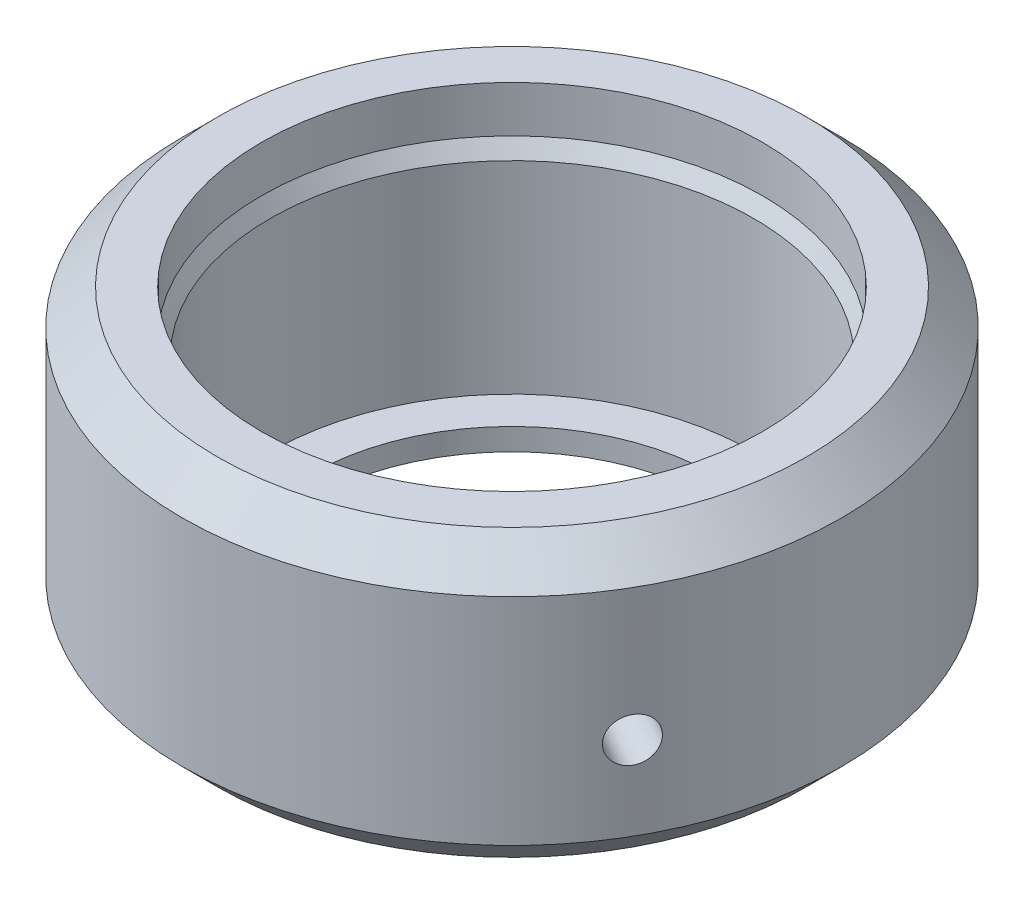
ISO-10303-21;
HEADER;
FILE_DESCRIPTION(('STEP AP214'),'2;1');
FILE_NAME('part.step','',(''),(''),'','','');
FILE_SCHEMA(('AUTOMOTIVE_DESIGN { 1 0 10303 214 1 1 1 1 }'));
ENDSEC;
DATA;
#1=APPLICATION_CONTEXT('core data for automotive mechanical design processes');
#2=APPLICATION_PROTOCOL_DEFINITION('international standard','automotive_design',2000,#1);
#3=PRODUCT_CONTEXT('',#1,'mechanical');
#4=PRODUCT('Part','Part','',(#3));
#5=PRODUCT_RELATED_PRODUCT_CATEGORY('part','',(#4));
#6=PRODUCT_DEFINITION_FORMATION('','',#4);
#7=PRODUCT_DEFINITION_CONTEXT('part definition',#1,'design');
#8=PRODUCT_DEFINITION('design','',#6,#7);
#9=PRODUCT_DEFINITION_SHAPE('','',#8);
#10=(LENGTH_UNIT() NAMED_UNIT(*) SI_UNIT(.MILLI.,.METRE.));
#11=(NAMED_UNIT(*) PLANE_ANGLE_UNIT() SI_UNIT($,.RADIAN.));
#12=(NAMED_UNIT(*) SI_UNIT($,.STERADIAN.) SOLID_ANGLE_UNIT());
#13=UNCERTAINTY_MEASURE_WITH_UNIT(LENGTH_MEASURE(1.E-05),#10,'distance_accuracy_value','');
#14=(GEOMETRIC_REPRESENTATION_CONTEXT(3) GLOBAL_UNCERTAINTY_ASSIGNED_CONTEXT((#13)) GLOBAL_UNIT_ASSIGNED_CONTEXT((#10,
#11,#12)) REPRESENTATION_CONTEXT('',''));
#15=CARTESIAN_POINT('',(0.,0.,0.));
#16=DIRECTION('',(0.,0.,1.));
#17=DIRECTION('',(1.,0.,0.));
#18=AXIS2_PLACEMENT_3D('',#15,#16,#17);
#19=CARTESIAN_POINT('',(0.,5.,0.));
#20=DIRECTION('',(0.,1.,0.));
#21=DIRECTION('',(0.,0.,1.));
#22=AXIS2_PLACEMENT_3D('',#19,#20,#21);
#23=PLANE('',#22);
#24=CARTESIAN_POINT('',(0.,5.,0.));
#25=DIRECTION('',(0.,1.,0.));
#26=DIRECTION('',(0.,0.,1.));
#27=AXIS2_PLACEMENT_3D('',#24,#25,#26);
#28=CIRCLE('',#27,46.);
#29=CARTESIAN_POINT('',(0.,5.,46.));
#30=VERTEX_POINT('',#29);
#31=EDGE_CURVE('E18',#30,#30,#28,.F.);
#32=ORIENTED_EDGE('',*,*,#31,.T.);
#33=EDGE_LOOP('',(#32));
#34=FACE_BOUND('',#33,.T.);
#35=CARTESIAN_POINT('',(0.,5.,0.));
#36=DIRECTION('',(0.,1.,0.));
#37=DIRECTION('',(0.,0.,1.));
#38=AXIS2_PLACEMENT_3D('',#35,#36,#37);
#39=CIRCLE('',#38,55.);
#40=CARTESIAN_POINT('',(0.,5.,55.));
#41=VERTEX_POINT('',#40);
#42=EDGE_CURVE('E116',#41,#41,#39,.T.);
#43=ORIENTED_EDGE('',*,*,#42,.T.);
#44=EDGE_LOOP('',(#43));
#45=FACE_BOUND('',#44,.T.);
#46=ADVANCED_FACE('F15',(#34,#45),#23,.T.);
#47=CARTESIAN_POINT('',(0.,54.4641016151031,0.));
#48=DIRECTION('',(0.,1.,0.));
#49=DIRECTION('',(0.,0.,1.));
#50=AXIS2_PLACEMENT_3D('',#47,#48,#49);
#51=CONICAL_SURFACE('',#50,56.9999999999946,0.523598775598);
#52=CARTESIAN_POINT('',(0.,51.,0.));
#53=DIRECTION('',(0.,1.,0.));
#54=DIRECTION('',(0.,0.,1.));
#55=AXIS2_PLACEMENT_3D('',#52,#53,#54);
#56=CIRCLE('',#55,55.);
#57=CARTESIAN_POINT('',(0.,51.,55.));
#58=VERTEX_POINT('',#57);
#59=EDGE_CURVE('E31',#58,#58,#56,.F.);
#60=ORIENTED_EDGE('',*,*,#59,.T.);
#61=EDGE_LOOP('',(#60));
#62=FACE_BOUND('',#61,.T.);
#63=CARTESIAN_POINT('',(0.,54.4641016151,0.));
#64=DIRECTION('',(0.,1.,0.));
#65=DIRECTION('',(0.,0.,1.));
#66=AXIS2_PLACEMENT_3D('',#63,#64,#65);
#67=CIRCLE('',#66,57.);
#68=CARTESIAN_POINT('',(0.,54.4641016151,57.));
#69=VERTEX_POINT('',#68);
#70=EDGE_CURVE('E113',#69,#69,#67,.T.);
#71=ORIENTED_EDGE('',*,*,#70,.T.);
#72=EDGE_LOOP('',(#71));
#73=FACE_BOUND('',#72,.T.);
#74=ADVANCED_FACE('F100',(#62,#73),#51,.F.);
#75=CARTESIAN_POINT('',(0.,-14.8,0.));
#76=DIRECTION('',(0.,1.,0.));
#77=DIRECTION('',(0.,0.,1.));
#78=AXIS2_PLACEMENT_3D('',#75,#76,#77);
#79=CYLINDRICAL_SURFACE('',#78,46.);
#80=CARTESIAN_POINT('',(0.,0.,0.));
#81=DIRECTION('',(0.,1.,0.));
#82=DIRECTION('',(0.,0.,1.));
#83=AXIS2_PLACEMENT_3D('',#80,#81,#82);
#84=CIRCLE('',#83,46.);
#85=CARTESIAN_POINT('',(0.,0.,46.));
#86=VERTEX_POINT('',#85);
#87=EDGE_CURVE('E84',#86,#86,#84,.F.);
#88=ORIENTED_EDGE('',*,*,#87,.T.);
#89=EDGE_LOOP('',(#88));
#90=FACE_BOUND('',#89,.T.);
#91=ORIENTED_EDGE('',*,*,#31,.F.);
#92=EDGE_LOOP('',(#91));
#93=FACE_BOUND('',#92,.T.);
#94=ADVANCED_FACE('F97',(#90,#93),#79,.F.);
#95=CARTESIAN_POINT('',(0.,0.226794919243,0.));
#96=DIRECTION('',(0.,1.,0.));
#97=DIRECTION('',(0.,0.,1.));
#98=AXIS2_PLACEMENT_3D('',#95,#96,#97);
#99=CYLINDRICAL_SURFACE('',#98,55.);
#100=ORIENTED_EDGE('',*,*,#42,.F.);
#101=EDGE_LOOP('',(#100));
#102=FACE_BOUND('',#101,.T.);
#103=CARTESIAN_POINT('',(49.9341649025134,27.,23.0560008563493));
#104=CARTESIAN_POINT('',(49.9341646831106,27.1400524558636,23.0560016059474));
#105=CARTESIAN_POINT('',(49.9316866792325,27.2801286113787,23.0613704849242));
#106=CARTESIAN_POINT('',(49.9217798817729,27.5593390878845,23.0828080834393));
#107=CARTESIAN_POINT('',(49.9143486889913,27.6984729194302,23.0988819882195));
#108=CARTESIAN_POINT('',(49.8945413156316,27.9749887511215,23.1416356996972));
#109=CARTESIAN_POINT('',(49.882156846797,28.1123674147543,23.1683332824835));
#110=CARTESIAN_POINT('',(49.8524789423696,28.3842029225961,23.2321238704768));
#111=CARTESIAN_POINT('',(49.8351836552412,28.5186586441387,23.2692207965018));
#112=CARTESIAN_POINT('',(49.7957718035326,28.7834637683973,23.3534423018323));
#113=CARTESIAN_POINT('',(49.7736617196794,28.9138184238087,23.400553400024));
#114=CARTESIAN_POINT('',(49.7246754070137,29.1697369217857,23.5044666833726));
#115=CARTESIAN_POINT('',(49.6977974210375,29.2952989772831,23.5612724411078));
#116=CARTESIAN_POINT('',(49.6394022951887,29.5405981238879,23.6840527514007));
#117=CARTESIAN_POINT('',(49.6078889564006,29.6603398817253,23.7500197890687));
#118=CARTESIAN_POINT('',(49.5403131644782,29.8933127354319,23.8906562787399));
#119=CARTESIAN_POINT('',(49.5042490317664,30.0065414049146,23.9653289429809));
#120=CARTESIAN_POINT('',(49.4276305274464,30.2259130669551,24.1229566046696));
#121=CARTESIAN_POINT('',(49.3870655185197,30.3320382806394,24.2059311752824));
#122=CARTESIAN_POINT('',(49.3016697909683,30.536194558105,24.3793909190933));
#123=CARTESIAN_POINT('',(49.2568375011667,30.6342226155754,24.4698788570724));
#124=CARTESIAN_POINT('',(49.1631301420865,30.8214247144555,24.6576080437347));
#125=CARTESIAN_POINT('',(49.1142561889423,30.9106011854255,24.754847426776));
#126=CARTESIAN_POINT('',(49.0126639626494,31.0795321555249,24.955388355847));
#127=CARTESIAN_POINT('',(48.9599442773914,31.1592831652817,25.0586921259046));
#128=CARTESIAN_POINT('',(48.8508635838258,31.3088591290109,25.2706816586983));
#129=CARTESIAN_POINT('',(48.7944977824968,31.3786706147861,25.3793744599359));
#130=CARTESIAN_POINT('',(48.6784652876514,31.5077637936086,25.6012245001598));
#131=CARTESIAN_POINT('',(48.6187973791334,31.5670415765692,25.714383377975));
#132=CARTESIAN_POINT('',(48.4965308244681,31.6745871169516,25.9442366959174));
#133=CARTESIAN_POINT('',(48.4339333516371,31.7228592375171,26.0609297140934));
#134=CARTESIAN_POINT('',(48.3061549500618,31.8080866118851,26.2970239837125));
#135=CARTESIAN_POINT('',(48.2409730665324,31.8450376383845,26.4164262289517));
#136=CARTESIAN_POINT('',(48.0425739195286,31.93824707524,26.7765886198401));
#137=CARTESIAN_POINT('',(47.9060258717888,31.9772811093191,27.0202039873204));
#138=CARTESIAN_POINT('',(47.6278765262335,32.0078811155544,27.5075274216295));
#139=CARTESIAN_POINT('',(47.4862753294983,31.9994480366878,27.7512354865077));
#140=CARTESIAN_POINT('',(47.2735075651719,31.9515812340089,28.111119446485));
#141=CARTESIAN_POINT('',(47.2025912466276,31.9297933115947,28.2300245932263));
#142=CARTESIAN_POINT('',(47.0610783765541,31.8746909347557,28.465306689131));
#143=CARTESIAN_POINT('',(46.990481715374,31.8413807933296,28.581684567003));
#144=CARTESIAN_POINT('',(46.8501289950332,31.7634554823514,28.8111702280211));
#145=CARTESIAN_POINT('',(46.7803732711757,31.7188359500871,28.924276730399));
#146=CARTESIAN_POINT('',(46.642312241264,31.6186382637426,29.1463856702377));
#147=CARTESIAN_POINT('',(46.5740064158544,31.5630641095839,29.2553895884477));
#148=CARTESIAN_POINT('',(46.4392594866758,31.4412301635673,29.468816376505));
#149=CARTESIAN_POINT('',(46.3728220921958,31.3749506659594,29.5732303376763));
#150=CARTESIAN_POINT('',(46.242532545933,31.2322782681088,29.7765471282467));
#151=CARTESIAN_POINT('',(46.1786794599752,31.1558890657348,29.8754519540399));
#152=CARTESIAN_POINT('',(46.0540678437818,30.9934940842437,30.0671900036574));
#153=CARTESIAN_POINT('',(45.99331025933,30.9074853913801,30.1600213742616));
#154=CARTESIAN_POINT('',(45.8754705872491,30.7265090360888,30.338962962367));
#155=CARTESIAN_POINT('',(45.8183871660028,30.6315446555294,30.4250756210063));
#156=CARTESIAN_POINT('',(45.7081782083963,30.4329186829776,30.5903964408339));
#157=CARTESIAN_POINT('',(45.6550685357965,30.3292254137514,30.669577122303));
#158=CARTESIAN_POINT('',(45.5535598771481,30.1142256381617,30.8201464339936));
#159=CARTESIAN_POINT('',(45.5051591688542,30.0029219407717,30.8915379141877));
#160=CARTESIAN_POINT('',(45.4134653975182,29.7733544778492,31.0261793157647));
#161=CARTESIAN_POINT('',(45.3701766452195,29.6550849624487,31.0894223698837));
#162=CARTESIAN_POINT('',(45.2891862816459,29.4125506682875,31.207286320829));
#163=CARTESIAN_POINT('',(45.2514825979048,29.2882881361751,31.2619104164079));
#164=CARTESIAN_POINT('',(45.1819650183459,29.0344330944785,31.3622985786138));
#165=CARTESIAN_POINT('',(45.1501592231563,28.9048335486517,31.4080504633292));
#166=CARTESIAN_POINT('',(45.0928290437925,28.6414347641686,31.4903045918895));
#167=CARTESIAN_POINT('',(45.0673022796643,28.5076371384686,31.5268103404729));
#168=CARTESIAN_POINT('',(45.0228100827017,28.2369853358395,31.5903161351384));
#169=CARTESIAN_POINT('',(45.0038335735914,28.1001367394368,31.6173322293058));
#170=CARTESIAN_POINT('',(44.9725819798215,27.8241921578405,31.6617689349636));
#171=CARTESIAN_POINT('',(44.9603036200017,27.685097305306,31.6791942360528));
#172=CARTESIAN_POINT('',(44.9456840835575,27.4548371097946,31.699930189001));
#173=CARTESIAN_POINT('',(44.9413663255226,27.3640361798798,31.7060501769074));
#174=CARTESIAN_POINT('',(44.9356065593277,27.1821601747837,31.7142127135207));
#175=CARTESIAN_POINT('',(44.9341645516668,27.0910850995548,31.7162552615198));
#176=CARTESIAN_POINT('',(44.9341654419887,26.8599475441367,31.7162543293846));
#177=CARTESIAN_POINT('',(44.9375760256319,26.719871388622,31.7114238755804));
#178=CARTESIAN_POINT('',(44.9511881318111,26.4406609121164,31.6921255380479));
#179=CARTESIAN_POINT('',(44.9613929452984,26.3015270805707,31.6776529839304));
#180=CARTESIAN_POINT('',(44.9885150588647,26.0250112488793,31.6391224396811));
#181=CARTESIAN_POINT('',(45.0054436093598,25.8876325852463,31.6150483836644));
#182=CARTESIAN_POINT('',(45.0458489268706,25.6157970774042,31.5574512705021));
#183=CARTESIAN_POINT('',(45.0693281636465,25.4813413558614,31.5239246494708));
#184=CARTESIAN_POINT('',(45.1225602009535,25.2165362316026,31.4476822320157));
#185=CARTESIAN_POINT('',(45.1523045668611,25.0861815761911,31.4049787886232));
#186=CARTESIAN_POINT('',(45.2178029536989,24.8302630782139,31.3105987557425));
#187=CARTESIAN_POINT('',(45.2535591899907,24.7047010227165,31.258918858217));
#188=CARTESIAN_POINT('',(45.3306924948646,24.4594018761117,31.1469570406283));
#189=CARTESIAN_POINT('',(45.3720649559034,24.3396601182743,31.0866821698458));
#190=CARTESIAN_POINT('',(45.4600718326965,24.1066872645678,30.9578415725246));
#191=CARTESIAN_POINT('',(45.5067081905416,23.9934585950852,30.8892727853103));
#192=CARTESIAN_POINT('',(45.6049084977432,23.7740869330448,30.744105383325));
#193=CARTESIAN_POINT('',(45.6564840792987,23.6679617193606,30.6674877697833));
#194=CARTESIAN_POINT('',(45.7640067601972,23.463805441895,30.5068030284438));
#195=CARTESIAN_POINT('',(45.8199554683224,23.3657773844246,30.4227331575763));
#196=CARTESIAN_POINT('',(45.9356800334637,23.1785752855445,30.2477156107602));
#197=CARTESIAN_POINT('',(45.9954548328538,23.0893988145745,30.1567698342333));
#198=CARTESIAN_POINT('',(46.1183322587814,22.9204678444751,29.9685179209011));
#199=CARTESIAN_POINT('',(46.1814361053291,22.8407168347182,29.8712094491594));
#200=CARTESIAN_POINT('',(46.3104840792822,22.691140870989,29.6707480310723));
#201=CARTESIAN_POINT('',(46.376431905698,22.6213293852139,29.5675874145979));
#202=CARTESIAN_POINT('',(46.5105434289399,22.4922362063913,29.3561753062854));
#203=CARTESIAN_POINT('',(46.5787079375326,22.4329584234307,29.2479219428106));
#204=CARTESIAN_POINT('',(46.7166334726824,22.3254128830483,29.0271093414661));
#205=CARTESIAN_POINT('',(46.7863938544516,22.2771407624829,28.9145518306938));
#206=CARTESIAN_POINT('',(46.926968288842,22.1919133881148,28.6858453540651));
#207=CARTESIAN_POINT('',(46.9977827247235,22.1549623616155,28.5696950644426));
#208=CARTESIAN_POINT('',(47.2104929312188,22.06175292476,28.217795167604));
#209=CARTESIAN_POINT('',(47.3531960043392,22.0227188906809,27.9777334056842));
#210=CARTESIAN_POINT('',(47.636155805533,21.9921188844456,27.4931872892328));
#211=CARTESIAN_POINT('',(47.7764125824571,22.0005519633122,27.2487030232148));
#212=CARTESIAN_POINT('',(47.981697352049,22.0484187659911,26.8844987542131));
#213=CARTESIAN_POINT('',(48.0492140704956,22.0702066884053,26.7636308474403));
#214=CARTESIAN_POINT('',(48.182217907568,22.1253090652443,26.5234360590419));
#215=CARTESIAN_POINT('',(48.2477057756537,22.1586192066704,26.4041086181016));
#216=CARTESIAN_POINT('',(48.3762698277294,22.2365445176487,26.1678167662872));
#217=CARTESIAN_POINT('',(48.4393450701931,22.281164049913,26.0508532861783));
#218=CARTESIAN_POINT('',(48.5626665395453,22.3813617362574,25.8202344570829));
#219=CARTESIAN_POINT('',(48.6229137891225,22.4369358904161,25.7065779179467));
#220=CARTESIAN_POINT('',(48.740373344839,22.5587698364328,25.4831702601675));
#221=CARTESIAN_POINT('',(48.7975797904831,22.6250493340407,25.3734268082009));
#222=CARTESIAN_POINT('',(48.9085125230018,22.7677217318913,25.1589343560046));
#223=CARTESIAN_POINT('',(48.9622400717167,22.8441109342653,25.0541835485586));
#224=CARTESIAN_POINT('',(49.0659842854609,23.0065059157565,24.8503976985197));
#225=CARTESIAN_POINT('',(49.1159998184464,23.09251460862,24.7513644016098));
#226=CARTESIAN_POINT('',(49.2120479434988,23.2734909639113,24.5598414579615));
#227=CARTESIAN_POINT('',(49.2580819828448,23.3684553444707,24.4673494357077));
#228=CARTESIAN_POINT('',(49.3461495337867,23.5670813170225,24.2892452687822));
#229=CARTESIAN_POINT('',(49.3881671791281,23.6707745862487,24.2036606023895));
#230=CARTESIAN_POINT('',(49.4678096987583,23.8857743618383,24.0404668694507));
#231=CARTESIAN_POINT('',(49.5054361800732,23.9970780592282,23.96285488641));
#232=CARTESIAN_POINT('',(49.5761921685721,24.2266455221507,23.8161250502758));
#233=CARTESIAN_POINT('',(49.6093178839028,24.3449150375513,23.7470143640275));
#234=CARTESIAN_POINT('',(49.6708958778251,24.5874493317126,23.6179426762383));
#235=CARTESIAN_POINT('',(49.6993498903847,24.7117118638249,23.5579782805129));
#236=CARTESIAN_POINT('',(49.7515297993149,24.9655669055217,23.4475802095022));
#237=CARTESIAN_POINT('',(49.7752491961546,25.0951664513486,23.3971596405227));
#238=CARTESIAN_POINT('',(49.8178182713722,25.3585652358319,23.30638318451));
#239=CARTESIAN_POINT('',(49.8366697949654,25.492362861532,23.2660234840069));
#240=CARTESIAN_POINT('',(49.8694213279521,25.763014664161,23.1957392138344));
#241=CARTESIAN_POINT('',(49.8833296972571,25.8998632605636,23.165797027786));
#242=CARTESIAN_POINT('',(49.9061872163318,26.1758078421597,23.1165140008438));
#243=CARTESIAN_POINT('',(49.9151387898332,26.3149026946942,23.0971679787787));
#244=CARTESIAN_POINT('',(49.9257868836373,26.5451628902055,23.0741391123519));
#245=CARTESIAN_POINT('',(49.9289280696188,26.6359638201202,23.0673398302528));
#246=CARTESIAN_POINT('',(49.9331171505844,26.8178398252162,23.0582704581025));
#247=CARTESIAN_POINT('',(49.9341650452052,26.9089149004452,23.0560003688376));
#248=CARTESIAN_POINT('',(49.9341649025134,27.,23.0560008563493));
#249=B_SPLINE_CURVE_WITH_KNOTS('',3,(#103,#104,#105,#106,#107,#108,#109,#110,#111,#112,#113,
#114,#115,#116,#117,#118,#119,#120,#121,#122,#123,#124,#125,#126,#127,#128,#129,#130,#131,#132,
#133,#134,#135,#136,#137,#138,#139,#140,#141,#142,#143,#144,#145,#146,#147,#148,#149,#150,#151,
#152,#153,#154,#155,#156,#157,#158,#159,#160,#161,#162,#163,#164,#165,#166,#167,#168,#169,#170,
#171,#172,#173,#174,#175,#176,#177,#178,#179,#180,#181,#182,#183,#184,#185,#186,#187,#188,#189,
#190,#191,#192,#193,#194,#195,#196,#197,#198,#199,#200,#201,#202,#203,#204,#205,#206,#207,#208,
#209,#210,#211,#212,#213,#214,#215,#216,#217,#218,#219,#220,#221,#222,#223,#224,#225,#226,#227,
#228,#229,#230,#231,#232,#233,#234,#235,#236,#237,#238,#239,#240,#241,#242,#243,#244,#245,#246,
#247,#248),.UNSPECIFIED.,.T.,.F.,(4,2,2,2,2,2,2,2,2,2,2,2,2,2,2,2,2,2,2,2,2,2,2,2,2,2,2,2,2,2,2,
2,2,2,2,2,2,2,2,2,2,2,2,2,2,2,2,2,2,2,2,2,2,2,2,2,2,2,2,2,2,2,2,2,2,2,2,2,2,2,2,2,4),(0.,
0.420073891223613,0.840351403678815,1.26133512337001,1.68247777863887,2.10305704063447,
2.52379162624822,2.94418310464884,3.36473019471167,3.78629326902516,4.20801216419457,
4.6296149851037,5.05137340067649,5.47369797415982,5.89617898758607,6.3184922179999,
6.74096294877347,7.58264295393847,8.42430613203715,8.84434369757892,9.26422420443425,
9.68426693162013,10.1041565694487,10.5248281127272,10.945346208309,11.3659920256771,
11.7864842893228,12.2085743769582,12.6305095054295,13.0527979348019,13.4749292698356,
13.8976361673013,14.3201825975521,14.7420109739492,15.1636329057662,15.4368338669647,
15.7100348755908,16.1301087668137,16.5503862792689,16.9713699989605,17.3925126542299,
17.8130919162258,18.2338265018398,18.6542179802402,19.0747650703028,19.4963281446162,
19.9180470397855,20.3396498606947,20.7614082762676,21.183732849751,21.6062138631773,
22.0285270935911,22.4509978243646,23.2926778295296,24.1343410076283,24.55437857317,
24.9742590800253,25.3943018072112,25.8141914450398,26.2348629883183,26.6553810839003,
27.0760269012683,27.4965191649139,27.9186092525492,28.3405443810203,28.7628328103928,
29.1849641454267,29.6076710428926,30.0302174731437,30.4520458495405,30.8736677813573,
31.1468687425556,31.4200697511816),.UNSPECIFIED.);
#250=CARTESIAN_POINT('',(49.9341649025134,27.,23.0560008563493));
#251=VERTEX_POINT('',#250);
#252=EDGE_CURVE('E80',#251,#251,#249,.T.);
#253=ORIENTED_EDGE('',*,*,#252,.T.);
#254=EDGE_LOOP('',(#253));
#255=FACE_BOUND('',#254,.T.);
#256=ORIENTED_EDGE('',*,*,#59,.F.);
#257=EDGE_LOOP('',(#256));
#258=FACE_BOUND('',#257,.T.);
#259=ADVANCED_FACE('F91',(#102,#255,#258),#99,.F.);
#260=CARTESIAN_POINT('',(0.,0.226794919243,0.));
#261=DIRECTION('',(0.,1.,0.));
#262=DIRECTION('',(0.,0.,1.));
#263=AXIS2_PLACEMENT_3D('',#260,#261,#262);
#264=CYLINDRICAL_SURFACE('',#263,57.);
#265=ORIENTED_EDGE('',*,*,#70,.F.);
#266=EDGE_LOOP('',(#265));
#267=FACE_BOUND('',#266,.T.);
#268=CARTESIAN_POINT('',(0.,65.,0.));
#269=DIRECTION('',(0.,1.,0.));
#270=DIRECTION('',(0.,0.,1.));
#271=AXIS2_PLACEMENT_3D('',#268,#269,#270);
#272=CIRCLE('',#271,57.);
#273=CARTESIAN_POINT('',(0.,65.,57.));
#274=VERTEX_POINT('',#273);
#275=EDGE_CURVE('E76',#274,#274,#272,.F.);
#276=ORIENTED_EDGE('',*,*,#275,.F.);
#277=EDGE_LOOP('',(#276));
#278=FACE_BOUND('',#277,.T.);
#279=ADVANCED_FACE('F96',(#267,#278),#264,.F.);
#280=CARTESIAN_POINT('',(0.,0.,0.));
#281=DIRECTION('',(0.,1.,0.));
#282=DIRECTION('',(0.,0.,1.));
#283=AXIS2_PLACEMENT_3D('',#280,#281,#282);
#284=PLANE('',#283);
#285=ORIENTED_EDGE('',*,*,#87,.F.);
#286=EDGE_LOOP('',(#285));
#287=FACE_BOUND('',#286,.T.);
#288=CARTESIAN_POINT('',(0.,0.,0.));
#289=DIRECTION('',(0.,1.,0.));
#290=DIRECTION('',(0.,0.,1.));
#291=AXIS2_PLACEMENT_3D('',#288,#289,#290);
#292=CIRCLE('',#291,66.9999862654897);
#293=CARTESIAN_POINT('',(0.,0.,66.9999862654897));
#294=VERTEX_POINT('',#293);
#295=EDGE_CURVE('E46',#294,#294,#292,.T.);
#296=ORIENTED_EDGE('',*,*,#295,.F.);
#297=EDGE_LOOP('',(#296));
#298=FACE_BOUND('',#297,.T.);
#299=ADVANCED_FACE('F71',(#287,#298),#284,.F.);
#300=CARTESIAN_POINT('',(64.9519052838,27.,37.5));
#301=DIRECTION('',(-0.866025403784329,0.,-0.50000000000019));
#302=DIRECTION('',(-0.50000000000019,0.,0.866025403784329));
#303=AXIS2_PLACEMENT_3D('',#300,#301,#302);
#304=CYLINDRICAL_SURFACE('',#303,5.);
#305=CARTESIAN_POINT('',(62.3074069840694,27.,41.7467008866753));
#306=CARTESIAN_POINT('',(62.3074074861104,27.1401994469576,41.7467002911984));
#307=CARTESIAN_POINT('',(62.3106999599183,27.2804233951994,41.7417873824169));
#308=CARTESIAN_POINT('',(62.3238432818683,27.5599302769909,41.72216070842));
#309=CARTESIAN_POINT('',(62.333697333337,27.6992127173359,41.7074421561409));
#310=CARTESIAN_POINT('',(62.359896051621,27.976028719541,41.6682603521341));
#311=CARTESIAN_POINT('',(62.3762516889803,28.1135589178319,41.6437806295385));
#312=CARTESIAN_POINT('',(62.415307418382,28.3856967596066,41.5852213803083));
#313=CARTESIAN_POINT('',(62.4380099004094,28.5203032815251,41.5511382373458));
#314=CARTESIAN_POINT('',(62.4895120149786,28.7854143956203,41.473642810776));
#315=CARTESIAN_POINT('',(62.5183038236183,28.9159240069547,41.430242497315));
#316=CARTESIAN_POINT('',(62.5817482069081,29.1721440348353,41.3343452317404));
#317=CARTESIAN_POINT('',(62.6164029415956,29.2978526615891,41.2818449268043));
#318=CARTESIAN_POINT('',(62.6912183925425,29.5434290589723,41.1681401283053));
#319=CARTESIAN_POINT('',(62.7313745261004,29.6633015796369,41.1069428777884));
#320=CARTESIAN_POINT('',(62.8168688814516,29.8965153291552,40.9761770512115));
#321=CARTESIAN_POINT('',(62.8622090131757,30.0098541275191,40.9066053892814));
#322=CARTESIAN_POINT('',(62.9577143990435,30.2292873172563,40.7594638962406));
#323=CARTESIAN_POINT('',(63.0078854598257,30.3353727217421,40.6818844317145));
#324=CARTESIAN_POINT('',(63.1125847140798,30.5394359359606,40.5192670571247));
#325=CARTESIAN_POINT('',(63.167114510573,30.6374107356225,40.4342264019105));
#326=CARTESIAN_POINT('',(63.2800271290261,30.8244897774911,40.2572872241693));
#327=CARTESIAN_POINT('',(63.3384088724225,30.9135964854236,40.1653906204061));
#328=CARTESIAN_POINT('',(63.4585638009289,31.0823704039535,39.9752839517123));
#329=CARTESIAN_POINT('',(63.5203382300083,31.1620341178896,39.8770715687377));
#330=CARTESIAN_POINT('',(63.6467750060881,31.3113573319504,39.6749573884008));
#331=CARTESIAN_POINT('',(63.7114388662404,31.3810115077936,39.5710526034191));
#332=CARTESIAN_POINT('',(63.8431138234919,31.5097919133778,39.3582581000635));
#333=CARTESIAN_POINT('',(63.9101257801333,31.5689142386251,39.2493665516661));
#334=CARTESIAN_POINT('',(64.045911258607,31.6761551761755,39.0274025779541));
#335=CARTESIAN_POINT('',(64.1146840826765,31.7242780743165,38.9143318010608));
#336=CARTESIAN_POINT('',(64.2534751677001,31.8092171999472,38.6847383654824));
#337=CARTESIAN_POINT('',(64.3234938843054,31.8460291969741,38.5682144330828));
#338=CARTESIAN_POINT('',(64.534326996492,31.9389240389082,38.2151191460154));
#339=CARTESIAN_POINT('',(64.6762730720848,31.9777446610178,37.9744454728639));
#340=CARTESIAN_POINT('',(64.9586925587562,32.0078785442037,37.4892920829422));
#341=CARTESIAN_POINT('',(65.0991659856969,31.9991923175098,37.2448124072375));
#342=CARTESIAN_POINT('',(65.3055882374112,31.9508965648093,36.880886161425));
#343=CARTESIAN_POINT('',(65.3736638473385,31.9289305459991,36.7600740355212));
#344=CARTESIAN_POINT('',(65.5080050761982,31.8734301566731,36.5201329772484));
#345=CARTESIAN_POINT('',(65.5742713625434,31.8399001157823,36.4010034322654));
#346=CARTESIAN_POINT('',(65.704592111578,31.7614928874273,36.1652421986604));
#347=CARTESIAN_POINT('',(65.7686457135702,31.7166113396702,36.0486114885962));
#348=CARTESIAN_POINT('',(65.8940961689231,31.6158478634393,35.8187830654639));
#349=CARTESIAN_POINT('',(65.9554939878311,31.5599699745472,35.705584109288));
#350=CARTESIAN_POINT('',(66.0753574380403,31.4375278369065,35.4832792879561));
#351=CARTESIAN_POINT('',(66.1338194615707,31.3709508424793,35.3741784985543));
#352=CARTESIAN_POINT('',(66.2473706910375,31.2276587584922,35.1610644214211));
#353=CARTESIAN_POINT('',(66.3024611261532,31.1509473962229,35.0570492824301));
#354=CARTESIAN_POINT('',(66.4089985915394,30.9878873826605,34.8548127988402));
#355=CARTESIAN_POINT('',(66.4604445452444,30.9015359029581,34.7565931676313));
#356=CARTESIAN_POINT('',(66.5593780148241,30.7198582192044,34.5667564779846));
#357=CARTESIAN_POINT('',(66.60686697635,30.6245353201244,34.4751370099088));
#358=CARTESIAN_POINT('',(66.6977554627325,30.4253486104688,34.2989688470936));
#359=CARTESIAN_POINT('',(66.7411460838704,30.3214670823713,34.2144355901167));
#360=CARTESIAN_POINT('',(66.8234873741324,30.1061140258595,34.0533363760883));
#361=CARTESIAN_POINT('',(66.8624396710157,29.9946453041692,33.9767674989969));
#362=CARTESIAN_POINT('',(66.9357611767427,29.7647750296687,33.8320921722314));
#363=CARTESIAN_POINT('',(66.9701265084103,29.6463677320817,33.7639928848336));
#364=CARTESIAN_POINT('',(67.0340579697725,29.4035895002707,33.6368865036269));
#365=CARTESIAN_POINT('',(67.0636258735214,29.2792207926738,33.5778760492444));
#366=CARTESIAN_POINT('',(67.1178732325256,29.0251994447716,33.4693110480961));
#367=CARTESIAN_POINT('',(67.1425464159366,28.8955402786289,33.4197686361355));
#368=CARTESIAN_POINT('',(67.1868345983051,28.6320588432693,33.3306425710748));
#369=CARTESIAN_POINT('',(67.2064515063952,28.4982381667934,33.2910551593346));
#370=CARTESIAN_POINT('',(67.2405207487787,28.2275767956956,33.2221890211941));
#371=CARTESIAN_POINT('',(67.2549818232519,28.0907416335025,33.1928928503146));
#372=CARTESIAN_POINT('',(67.2787156723388,27.8148567991697,33.1447603955084));
#373=CARTESIAN_POINT('',(67.2879909905833,27.6758082471892,33.1259189835216));
#374=CARTESIAN_POINT('',(67.2989043125692,27.4471276494529,33.1037394138415));
#375=CARTESIAN_POINT('',(67.3020921105015,27.3578597473958,33.0972569988191));
#376=CARTESIAN_POINT('',(67.3063435308545,27.179064561302,33.0886104822334));
#377=CARTESIAN_POINT('',(67.3074071531056,27.0895372772445,33.0864463810147));
#378=CARTESIAN_POINT('',(67.3074067193937,26.8598005530424,33.0864475813507));
#379=CARTESIAN_POINT('',(67.3047982524864,26.7195766048006,33.0917554017003));
#380=CARTESIAN_POINT('',(67.2943727151883,26.4400697230091,33.1129511893975));
#381=CARTESIAN_POINT('',(67.286553100742,26.3007872826641,33.1288443244393));
#382=CARTESIAN_POINT('',(67.265720022248,26.023971280459,33.1711239820232));
#383=CARTESIAN_POINT('',(67.2526977792822,25.8864410821681,33.1975282407692));
#384=CARTESIAN_POINT('',(67.2215118465232,25.6143032403934,33.2606311192095));
#385=CARTESIAN_POINT('',(67.2033462198905,25.4796967184749,33.2973336168555));
#386=CARTESIAN_POINT('',(67.1619842690885,25.2145856043797,33.3806834697058));
#387=CARTESIAN_POINT('',(67.1387943994189,25.0840759930453,33.4273180641392));
#388=CARTESIAN_POINT('',(67.0874671229227,24.8278559651647,33.5302111445829));
#389=CARTESIAN_POINT('',(67.0593278924854,24.7021473384109,33.5864731776517));
#390=CARTESIAN_POINT('',(66.9982643739265,24.4565709410277,33.7081176580168));
#391=CARTESIAN_POINT('',(66.965344067116,24.3366984203631,33.7734925150541));
#392=CARTESIAN_POINT('',(66.894844717029,24.1034846708448,33.9129157119569));
#393=CARTESIAN_POINT('',(66.8572639562761,23.9901458724809,33.9869672488058));
#394=CARTESIAN_POINT('',(66.7775883782858,23.7707126827437,34.143248085686));
#395=CARTESIAN_POINT('',(66.7354881215852,23.6646272782579,34.2254872311213));
#396=CARTESIAN_POINT('',(66.6470069712208,23.4605640640394,34.3974681323574));
#397=CARTESIAN_POINT('',(66.6006245016973,23.3625892643775,34.4872126489908));
#398=CARTESIAN_POINT('',(66.5038469880752,23.1755102225089,34.6734674338495));
#399=CARTESIAN_POINT('',(66.4534530663929,23.0864035145764,34.7699758086297));
#400=CARTESIAN_POINT('',(66.3488933261283,22.9176295960466,34.9690863634529));
#401=CARTESIAN_POINT('',(66.2947261220458,22.8379658821104,35.0716907798272));
#402=CARTESIAN_POINT('',(66.1829084954488,22.6886426680496,35.2822453300534));
#403=CARTESIAN_POINT('',(66.1252562421559,22.6189884922064,35.3901982681429));
#404=CARTESIAN_POINT('',(66.00680827509,22.4902080866222,35.6106293778427));
#405=CARTESIAN_POINT('',(65.946011406241,22.4310857613749,35.7231092088501));
#406=CARTESIAN_POINT('',(65.8216777055183,22.3238448238245,35.9516848695293));
#407=CARTESIAN_POINT('',(65.7581419523378,22.2757219256835,36.0677792707101));
#408=CARTESIAN_POINT('',(65.6287037470964,22.1907828000528,36.3027725939484));
#409=CARTESIAN_POINT('',(65.5628004197921,22.1539708030259,36.4216725474688));
#410=CARTESIAN_POINT('',(65.3624274873283,22.0610759610918,36.780807022115));
#411=CARTESIAN_POINT('',(65.2249710101533,22.0222553389822,37.0240727661215));
#412=CARTESIAN_POINT('',(64.9460255930844,21.9921214557963,37.5112319110635));
#413=CARTESIAN_POINT('',(64.8045366966854,22.0008076824902,37.755125305203));
#414=CARTESIAN_POINT('',(64.5925784485649,22.0491034351907,38.1158553420002));
#415=CARTESIAN_POINT('',(64.5219898834106,22.0710694540009,38.2352166125272));
#416=CARTESIAN_POINT('',(64.3813654459652,22.1265698433269,38.4715300586316));
#417=CARTESIAN_POINT('',(64.3113293768411,22.1600998842177,38.5884831185126));
#418=CARTESIAN_POINT('',(64.1723145338289,22.2385071125727,38.8192248146191));
#419=CARTESIAN_POINT('',(64.1033361770479,22.2833886603299,38.9330122161803));
#420=CARTESIAN_POINT('',(63.96702415178,22.3841521365607,39.1565697089984));
#421=CARTESIAN_POINT('',(63.8996898895037,22.4400300254528,39.2663412579976));
#422=CARTESIAN_POINT('',(63.767099991951,22.5624721630935,39.4812984615299));
#423=CARTESIAN_POINT('',(63.7018469485213,22.6290491575207,39.5864784537647));
#424=CARTESIAN_POINT('',(63.5740603585532,22.7723412415078,39.7913737416805));
#425=CARTESIAN_POINT('',(63.5115258233666,22.8490526037771,39.8910910274917));
#426=CARTESIAN_POINT('',(63.3896526236987,23.0121126173395,40.0844734207658));
#427=CARTESIAN_POINT('',(63.3303149047739,23.0984640970419,40.1781367392007));
#428=CARTESIAN_POINT('',(63.2153782437594,23.2801417807956,40.3587339819645));
#429=CARTESIAN_POINT('',(63.1597779376874,23.3754646798756,40.4456703630833));
#430=CARTESIAN_POINT('',(63.0526560765426,23.5746513895312,40.6124661826095));
#431=CARTESIAN_POINT('',(63.0011434391048,23.6785329176287,40.6923101912893));
#432=CARTESIAN_POINT('',(62.9027980723574,23.8938859741405,40.8441694474508));
#433=CARTESIAN_POINT('',(62.8559636280987,24.0053546958308,40.9161875646332));
#434=CARTESIAN_POINT('',(62.7673318726824,24.2352249703313,41.0520235146191));
#435=CARTESIAN_POINT('',(62.72553882565,24.3536322679183,41.1158344085517));
#436=CARTESIAN_POINT('',(62.6474272012229,24.5964104997293,41.2347538687957));
#437=CARTESIAN_POINT('',(62.6111066005133,24.7207792073262,41.2898656517702));
#438=CARTESIAN_POINT('',(62.544210231059,24.9748005552284,41.3911277433301));
#439=CARTESIAN_POINT('',(62.5136418354419,25.1044597213711,41.4372665529366));
#440=CARTESIAN_POINT('',(62.4586004901442,25.3679411567307,41.5201842764854));
#441=CARTESIAN_POINT('',(62.4341252399521,25.5017618332066,41.5569667231053));
#442=CARTESIAN_POINT('',(62.3915200360537,25.7724232043044,41.6209046215673));
#443=CARTESIAN_POINT('',(62.3733793450751,25.9092583664975,41.6480763648669));
#444=CARTESIAN_POINT('',(62.3435623410097,26.1851432008303,41.6926967085088));
#445=CARTESIAN_POINT('',(62.3318828587082,26.3241917528108,41.7101500757301));
#446=CARTESIAN_POINT('',(62.3181314489132,26.5528723505471,41.7306910746497));
#447=CARTESIAN_POINT('',(62.314111411792,26.6421402526042,41.7366929961523));
#448=CARTESIAN_POINT('',(62.3087490189511,26.820935438698,41.744698092473));
#449=CARTESIAN_POINT('',(62.3074066634449,26.9104627227555,41.7467012669719));
#450=CARTESIAN_POINT('',(62.3074069840694,27.,41.7467008866753));
#451=B_SPLINE_CURVE_WITH_KNOTS('',3,(#305,#306,#307,#308,#309,#310,#311,#312,#313,#314,#315,
#316,#317,#318,#319,#320,#321,#322,#323,#324,#325,#326,#327,#328,#329,#330,#331,#332,#333,#334,
#335,#336,#337,#338,#339,#340,#341,#342,#343,#344,#345,#346,#347,#348,#349,#350,#351,#352,#353,
#354,#355,#356,#357,#358,#359,#360,#361,#362,#363,#364,#365,#366,#367,#368,#369,#370,#371,#372,
#373,#374,#375,#376,#377,#378,#379,#380,#381,#382,#383,#384,#385,#386,#387,#388,#389,#390,#391,
#392,#393,#394,#395,#396,#397,#398,#399,#400,#401,#402,#403,#404,#405,#406,#407,#408,#409,#410,
#411,#412,#413,#414,#415,#416,#417,#418,#419,#420,#421,#422,#423,#424,#425,#426,#427,#428,#429,
#430,#431,#432,#433,#434,#435,#436,#437,#438,#439,#440,#441,#442,#443,#444,#445,#446,#447,#448,
#449,#450),.UNSPECIFIED.,.T.,.F.,(4,2,2,2,2,2,2,2,2,2,2,2,2,2,2,2,2,2,2,2,2,2,2,2,2,2,2,2,2,2,2,
2,2,2,2,2,2,2,2,2,2,2,2,2,2,2,2,2,2,2,2,2,2,2,2,2,2,2,2,2,2,2,2,2,2,2,2,2,2,2,2,2,4),(0.,
0.420516327912911,0.841238100281732,1.26267281765867,1.6842664458836,2.10532164293363,
2.52653230560844,2.94739420659717,3.36841166763894,3.78994165134138,4.21162738165705,
4.63319553499385,5.05491930702214,5.47686657888035,5.89896995599352,6.32090858249306,
6.7430048294061,7.58502365274805,8.42703339726791,8.84781930867895,9.26844784656303,
9.68923820054371,10.1098742618853,10.5310151865911,10.952001650037,11.3731119571064,
11.7940677345512,12.2159179668345,12.637612983775,13.059662215213,13.4815550184134,
13.9039849705005,14.3262551883718,14.7478061306443,15.169150118954,15.437709552326,
15.7062690071257,16.1267853350386,16.5475071074074,16.9689418247843,17.3905354530093,
17.8115906500593,18.2328013127341,18.6536632137229,19.0746806747646,19.4962106584671,
19.9178963887827,20.3394645421195,20.7611883141478,21.1831355860061,21.6052389631192,
22.0271775896187,22.4492738365318,23.2912926598737,24.1333024043936,24.5540883158046,
24.9747168536887,25.3955072076694,25.816143269011,26.2372841937168,26.6582706571627,
27.0793809642321,27.5003367416769,27.9221869739602,28.3438819909007,28.7659312223387,
29.1878240255391,29.6102539776262,30.0325241954975,30.45407513777,30.8754191260797,
31.1439785594516,31.4125380142514),.UNSPECIFIED.);
#452=CARTESIAN_POINT('',(62.3074069840694,27.,41.7467008866753));
#453=VERTEX_POINT('',#452);
#454=EDGE_CURVE('E37',#453,#453,#451,.T.);
#455=ORIENTED_EDGE('',*,*,#454,.F.);
#456=EDGE_LOOP('',(#455));
#457=FACE_BOUND('',#456,.T.);
#458=ORIENTED_EDGE('',*,*,#252,.F.);
#459=EDGE_LOOP('',(#458));
#460=FACE_BOUND('',#459,.T.);
#461=ADVANCED_FACE('F48',(#457,#460),#304,.F.);
#462=CARTESIAN_POINT('',(0.,65.,0.));
#463=DIRECTION('',(0.,1.,0.));
#464=DIRECTION('',(0.,0.,1.));
#465=AXIS2_PLACEMENT_3D('',#462,#463,#464);
#466=PLANE('',#465);
#467=ORIENTED_EDGE('',*,*,#275,.T.);
#468=EDGE_LOOP('',(#467));
#469=FACE_BOUND('',#468,.T.);
#470=CARTESIAN_POINT('',(0.,65.,0.));
#471=DIRECTION('',(0.,1.,0.));
#472=DIRECTION('',(0.,0.,1.));
#473=AXIS2_PLACEMENT_3D('',#470,#471,#472);
#474=CIRCLE('',#473,66.9999862654887);
#475=CARTESIAN_POINT('',(0.,65.,66.9999862654887));
#476=VERTEX_POINT('',#475);
#477=EDGE_CURVE('E27',#476,#476,#474,.F.);
#478=ORIENTED_EDGE('',*,*,#477,.F.);
#479=EDGE_LOOP('',(#478));
#480=FACE_BOUND('',#479,.T.);
#481=ADVANCED_FACE('F63',(#469,#480),#466,.T.);
#482=CARTESIAN_POINT('',(0.,8.00000768722666,0.));
#483=DIRECTION('',(0.,1.,0.));
#484=DIRECTION('',(0.,0.,1.));
#485=AXIS2_PLACEMENT_3D('',#482,#483,#484);
#486=CONICAL_SURFACE('',#485,74.9999923127718,0.785398060900999);
#487=CARTESIAN_POINT('',(0.,8.00001537445647,0.));
#488=DIRECTION('',(0.,1.,0.));
#489=DIRECTION('',(0.,0.,1.));
#490=AXIS2_PLACEMENT_3D('',#487,#488,#489);
#491=CIRCLE('',#490,75.);
#492=CARTESIAN_POINT('',(0.,8.00001537445647,75.));
#493=VERTEX_POINT('',#492);
#494=EDGE_CURVE('E22',#493,#493,#491,.T.);
#495=ORIENTED_EDGE('',*,*,#494,.F.);
#496=EDGE_LOOP('',(#495));
#497=FACE_BOUND('',#496,.T.);
#498=ORIENTED_EDGE('',*,*,#295,.T.);
#499=EDGE_LOOP('',(#498));
#500=FACE_BOUND('',#499,.T.);
#501=ADVANCED_FACE('F60',(#497,#500),#486,.T.);
#502=CARTESIAN_POINT('',(0.,56.9999923127728,0.));
#503=DIRECTION('',(0.,-1.,0.));
#504=DIRECTION('',(1.,0.,0.));
#505=AXIS2_PLACEMENT_3D('',#502,#503,#504);
#506=CONICAL_SURFACE('',#505,74.9999923127713,0.785398060901);
#507=CARTESIAN_POINT('',(0.,56.9999846255425,0.));
#508=DIRECTION('',(0.,-1.,0.));
#509=DIRECTION('',(1.,0.,0.));
#510=AXIS2_PLACEMENT_3D('',#507,#508,#509);
#511=CIRCLE('',#510,75.);
#512=CARTESIAN_POINT('',(74.9999999999999,56.9999846255425,0.));
#513=VERTEX_POINT('',#512);
#514=EDGE_CURVE('E10',#513,#513,#511,.T.);
#515=ORIENTED_EDGE('',*,*,#514,.F.);
#516=EDGE_LOOP('',(#515));
#517=FACE_BOUND('',#516,.T.);
#518=ORIENTED_EDGE('',*,*,#477,.T.);
#519=EDGE_LOOP('',(#518));
#520=FACE_BOUND('',#519,.T.);
#521=ADVANCED_FACE('F56',(#517,#520),#506,.T.);
#522=CARTESIAN_POINT('',(0.,0.,0.));
#523=DIRECTION('',(0.,1.,0.));
#524=DIRECTION('',(0.,0.,1.));
#525=AXIS2_PLACEMENT_3D('',#522,#523,#524);
#526=CYLINDRICAL_SURFACE('',#525,75.);
#527=ORIENTED_EDGE('',*,*,#494,.T.);
#528=EDGE_LOOP('',(#527));
#529=FACE_BOUND('',#528,.T.);
#530=ORIENTED_EDGE('',*,*,#514,.T.);
#531=EDGE_LOOP('',(#530));
#532=FACE_BOUND('',#531,.T.);
#533=ORIENTED_EDGE('',*,*,#454,.T.);
#534=EDGE_LOOP('',(#533));
#535=FACE_BOUND('',#534,.T.);
#536=ADVANCED_FACE('F52',(#529,#532,#535),#526,.T.);
#537=CLOSED_SHELL('',(#46,#74,#94,#259,#279,#299,#461,#481,#501,#521,#536));
#538=MANIFOLD_SOLID_BREP('B1',#537);
#539=ADVANCED_BREP_SHAPE_REPRESENTATION('',(#18,#538),#14);
#540=SHAPE_DEFINITION_REPRESENTATION(#9,#539);
ENDSEC;
END-ISO-10303-21;
